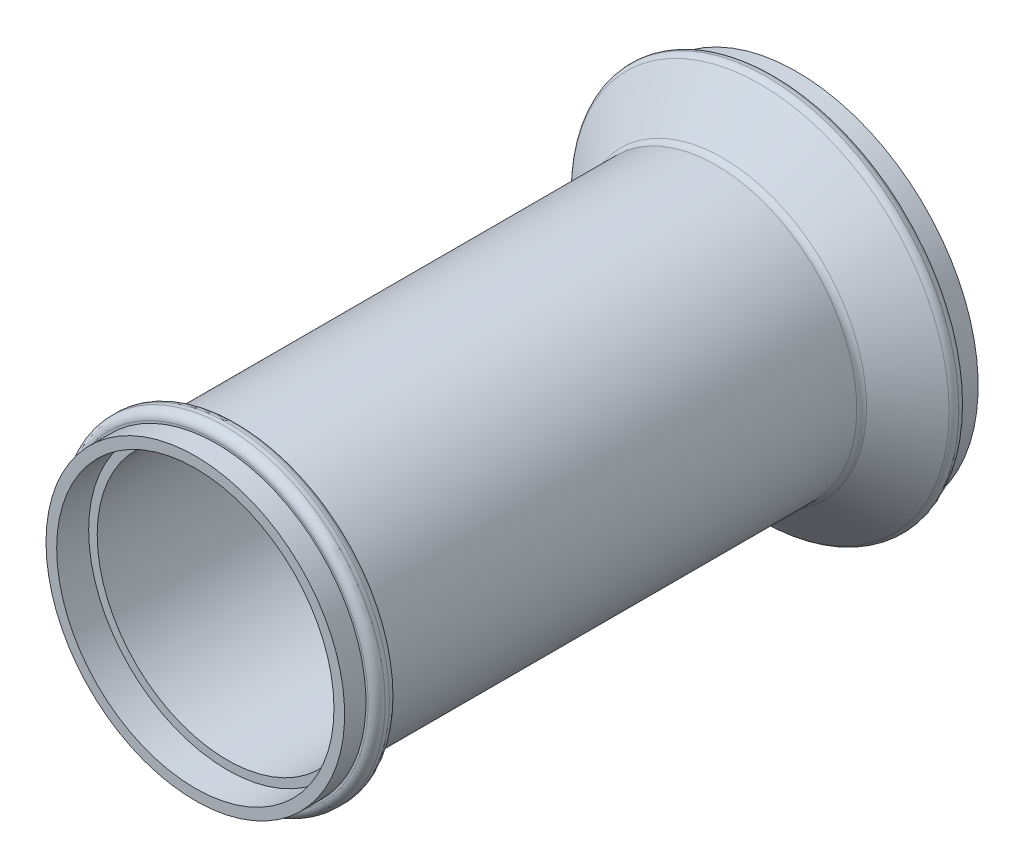
ISO-10303-21;
HEADER;
FILE_DESCRIPTION(('STEP AP214'),'2;1');
FILE_NAME('part.step','',(''),(''),'','','');
FILE_SCHEMA(('AUTOMOTIVE_DESIGN { 1 0 10303 214 1 1 1 1 }'));
ENDSEC;
DATA;
#1=APPLICATION_CONTEXT('core data for automotive mechanical design processes');
#2=APPLICATION_PROTOCOL_DEFINITION('international standard','automotive_design',2000,#1);
#3=PRODUCT_CONTEXT('',#1,'mechanical');
#4=PRODUCT('Part','Part','',(#3));
#5=PRODUCT_RELATED_PRODUCT_CATEGORY('part','',(#4));
#6=PRODUCT_DEFINITION_FORMATION('','',#4);
#7=PRODUCT_DEFINITION_CONTEXT('part definition',#1,'design');
#8=PRODUCT_DEFINITION('design','',#6,#7);
#9=PRODUCT_DEFINITION_SHAPE('','',#8);
#10=(LENGTH_UNIT() NAMED_UNIT(*) SI_UNIT(.MILLI.,.METRE.));
#11=(NAMED_UNIT(*) PLANE_ANGLE_UNIT() SI_UNIT($,.RADIAN.));
#12=(NAMED_UNIT(*) SI_UNIT($,.STERADIAN.) SOLID_ANGLE_UNIT());
#13=UNCERTAINTY_MEASURE_WITH_UNIT(LENGTH_MEASURE(1.E-05),#10,'distance_accuracy_value','');
#14=(GEOMETRIC_REPRESENTATION_CONTEXT(3) GLOBAL_UNCERTAINTY_ASSIGNED_CONTEXT((#13)) GLOBAL_UNIT_ASSIGNED_CONTEXT((#10,
#11,#12)) REPRESENTATION_CONTEXT('',''));
#15=CARTESIAN_POINT('',(0.,0.,0.));
#16=DIRECTION('',(0.,0.,1.));
#17=DIRECTION('',(1.,0.,0.));
#18=AXIS2_PLACEMENT_3D('',#15,#16,#17);
#19=CARTESIAN_POINT('',(0.,0.,0.));
#20=DIRECTION('',(0.,0.,1.));
#21=DIRECTION('',(1.,0.,0.));
#22=AXIS2_PLACEMENT_3D('',#19,#20,#21);
#23=PLANE('',#22);
#24=CARTESIAN_POINT('',(0.,0.,0.));
#25=DIRECTION('',(0.,0.,-1.));
#26=DIRECTION('',(-1.,0.,0.));
#27=AXIS2_PLACEMENT_3D('',#24,#25,#26);
#28=CIRCLE('',#27,40.);
#29=CARTESIAN_POINT('',(-40.,0.,0.));
#30=VERTEX_POINT('',#29);
#31=EDGE_CURVE('E93',#30,#30,#28,.T.);
#32=ORIENTED_EDGE('',*,*,#31,.F.);
#33=EDGE_LOOP('',(#32));
#34=FACE_BOUND('',#33,.T.);
#35=CARTESIAN_POINT('',(0.,0.,0.));
#36=DIRECTION('',(0.,0.,-1.));
#37=DIRECTION('',(-1.,0.,0.));
#38=AXIS2_PLACEMENT_3D('',#35,#36,#37);
#39=CIRCLE('',#38,42.5);
#40=CARTESIAN_POINT('',(-42.5,0.,0.));
#41=VERTEX_POINT('',#40);
#42=EDGE_CURVE('E78',#41,#41,#39,.T.);
#43=ORIENTED_EDGE('',*,*,#42,.T.);
#44=EDGE_LOOP('',(#43));
#45=FACE_BOUND('',#44,.T.);
#46=ADVANCED_FACE('F34',(#34,#45),#23,.F.);
#47=CARTESIAN_POINT('',(0.,0.,0.));
#48=DIRECTION('',(0.,0.,-1.));
#49=DIRECTION('',(-1.,0.,0.));
#50=AXIS2_PLACEMENT_3D('',#47,#48,#49);
#51=CYLINDRICAL_SURFACE('',#50,42.5);
#52=ORIENTED_EDGE('',*,*,#42,.F.);
#53=EDGE_LOOP('',(#52));
#54=FACE_BOUND('',#53,.T.);
#55=CARTESIAN_POINT('',(0.,0.,5.));
#56=DIRECTION('',(0.,0.,-1.));
#57=DIRECTION('',(-1.,0.,0.));
#58=AXIS2_PLACEMENT_3D('',#55,#56,#57);
#59=CIRCLE('',#58,42.5);
#60=CARTESIAN_POINT('',(-42.5,0.,5.00000000000001));
#61=VERTEX_POINT('',#60);
#62=EDGE_CURVE('E81',#61,#61,#59,.T.);
#63=ORIENTED_EDGE('',*,*,#62,.T.);
#64=EDGE_LOOP('',(#63));
#65=FACE_BOUND('',#64,.T.);
#66=ADVANCED_FACE('F128',(#54,#65),#51,.T.);
#67=CARTESIAN_POINT('',(42.5,0.,5.));
#68=DIRECTION('',(0.,0.,1.));
#69=DIRECTION('',(1.,0.,0.));
#70=AXIS2_PLACEMENT_3D('',#67,#68,#69);
#71=PLANE('',#70);
#72=CARTESIAN_POINT('',(0.,0.,5.));
#73=DIRECTION('',(0.,0.,1.));
#74=DIRECTION('',(1.,0.,0.));
#75=AXIS2_PLACEMENT_3D('',#72,#73,#74);
#76=CIRCLE('',#75,43.);
#77=CARTESIAN_POINT('',(43.,0.,5.));
#78=VERTEX_POINT('',#77);
#79=EDGE_CURVE('E10',#78,#78,#76,.F.);
#80=ORIENTED_EDGE('',*,*,#79,.T.);
#81=EDGE_LOOP('',(#80));
#82=FACE_BOUND('',#81,.T.);
#83=ORIENTED_EDGE('',*,*,#62,.F.);
#84=EDGE_LOOP('',(#83));
#85=FACE_BOUND('',#84,.T.);
#86=ADVANCED_FACE('F134',(#82,#85),#71,.F.);
#87=CARTESIAN_POINT('',(0.,0.,0.));
#88=DIRECTION('',(0.,0.,-1.));
#89=DIRECTION('',(-1.,0.,0.));
#90=AXIS2_PLACEMENT_3D('',#87,#88,#89);
#91=CYLINDRICAL_SURFACE('',#90,45.);
#92=CARTESIAN_POINT('',(0.,0.,7.06325010803113));
#93=DIRECTION('',(0.,0.,1.));
#94=DIRECTION('',(1.,0.,0.));
#95=AXIS2_PLACEMENT_3D('',#92,#93,#94);
#96=CIRCLE('',#95,45.);
#97=CARTESIAN_POINT('',(45.,0.,7.06325010803112));
#98=VERTEX_POINT('',#97);
#99=EDGE_CURVE('E41',#98,#98,#96,.F.);
#100=ORIENTED_EDGE('',*,*,#99,.T.);
#101=EDGE_LOOP('',(#100));
#102=FACE_BOUND('',#101,.T.);
#103=CARTESIAN_POINT('',(0.,0.,7.));
#104=DIRECTION('',(0.,0.,1.));
#105=DIRECTION('',(1.,0.,0.));
#106=AXIS2_PLACEMENT_3D('',#103,#104,#105);
#107=CIRCLE('',#106,45.);
#108=CARTESIAN_POINT('',(45.,0.,7.));
#109=VERTEX_POINT('',#108);
#110=EDGE_CURVE('E45',#109,#109,#107,.T.);
#111=ORIENTED_EDGE('',*,*,#110,.T.);
#112=EDGE_LOOP('',(#111));
#113=FACE_BOUND('',#112,.T.);
#114=ADVANCED_FACE('F167',(#102,#113),#91,.T.);
#115=CARTESIAN_POINT('',(0.,0.,18.));
#116=DIRECTION('',(0.,0.,-1.));
#117=DIRECTION('',(-1.,0.,0.));
#118=AXIS2_PLACEMENT_3D('',#115,#116,#117);
#119=CONICAL_SURFACE('',#118,33.,0.876058050598193);
#120=CARTESIAN_POINT('',(0.,0.,17.4003073327741));
#121=DIRECTION('',(0.,0.,-1.));
#122=DIRECTION('',(-1.,0.,0.));
#123=AXIS2_PLACEMENT_3D('',#120,#121,#122);
#124=CIRCLE('',#123,33.719631200671);
#125=CARTESIAN_POINT('',(-33.719631200671,0.,17.4003073327741));
#126=VERTEX_POINT('',#125);
#127=EDGE_CURVE('E49',#126,#126,#124,.T.);
#128=ORIENTED_EDGE('',*,*,#127,.T.);
#129=EDGE_LOOP('',(#128));
#130=FACE_BOUND('',#129,.T.);
#131=CARTESIAN_POINT('',(0.,0.,8.59969266722588));
#132=DIRECTION('',(0.,0.,1.));
#133=DIRECTION('',(1.,0.,0.));
#134=AXIS2_PLACEMENT_3D('',#131,#132,#133);
#135=CIRCLE('',#134,44.280368799329);
#136=CARTESIAN_POINT('',(44.280368799329,0.,8.59969266722587));
#137=VERTEX_POINT('',#136);
#138=EDGE_CURVE('E54',#137,#137,#135,.T.);
#139=ORIENTED_EDGE('',*,*,#138,.T.);
#140=EDGE_LOOP('',(#139));
#141=FACE_BOUND('',#140,.T.);
#142=ADVANCED_FACE('F164',(#130,#141),#119,.T.);
#143=CARTESIAN_POINT('',(0.,0.,0.));
#144=DIRECTION('',(0.,0.,-1.));
#145=DIRECTION('',(-1.,0.,0.));
#146=AXIS2_PLACEMENT_3D('',#143,#144,#145);
#147=CYLINDRICAL_SURFACE('',#146,33.);
#148=CARTESIAN_POINT('',(0.,0.,129.));
#149=DIRECTION('',(0.,0.,1.));
#150=DIRECTION('',(1.,0.,0.));
#151=AXIS2_PLACEMENT_3D('',#148,#149,#150);
#152=CIRCLE('',#151,33.);
#153=CARTESIAN_POINT('',(33.,0.,129.));
#154=VERTEX_POINT('',#153);
#155=EDGE_CURVE('E57',#154,#154,#152,.F.);
#156=ORIENTED_EDGE('',*,*,#155,.T.);
#157=EDGE_LOOP('',(#156));
#158=FACE_BOUND('',#157,.T.);
#159=CARTESIAN_POINT('',(0.,0.,18.9367498919689));
#160=DIRECTION('',(0.,0.,-1.));
#161=DIRECTION('',(-1.,0.,0.));
#162=AXIS2_PLACEMENT_3D('',#159,#160,#161);
#163=CIRCLE('',#162,33.);
#164=CARTESIAN_POINT('',(-33.,0.,18.9367498919689));
#165=VERTEX_POINT('',#164);
#166=EDGE_CURVE('E60',#165,#165,#163,.F.);
#167=ORIENTED_EDGE('',*,*,#166,.T.);
#168=EDGE_LOOP('',(#167));
#169=FACE_BOUND('',#168,.T.);
#170=ADVANCED_FACE('F166',(#158,#169),#147,.T.);
#171=CARTESIAN_POINT('',(33.,0.,131.));
#172=DIRECTION('',(0.,0.,1.));
#173=DIRECTION('',(1.,0.,0.));
#174=AXIS2_PLACEMENT_3D('',#171,#172,#173);
#175=PLANE('',#174);
#176=CARTESIAN_POINT('',(0.,0.,131.));
#177=DIRECTION('',(0.,0.,1.));
#178=DIRECTION('',(1.,0.,0.));
#179=AXIS2_PLACEMENT_3D('',#176,#177,#178);
#180=CIRCLE('',#179,35.5);
#181=CARTESIAN_POINT('',(35.5,0.,131.));
#182=VERTEX_POINT('',#181);
#183=EDGE_CURVE('E63',#182,#182,#180,.F.);
#184=ORIENTED_EDGE('',*,*,#183,.T.);
#185=EDGE_LOOP('',(#184));
#186=FACE_BOUND('',#185,.T.);
#187=CARTESIAN_POINT('',(0.,0.,131.));
#188=DIRECTION('',(0.,0.,1.));
#189=DIRECTION('',(1.,0.,0.));
#190=AXIS2_PLACEMENT_3D('',#187,#188,#189);
#191=CIRCLE('',#190,35.);
#192=CARTESIAN_POINT('',(35.,0.,131.));
#193=VERTEX_POINT('',#192);
#194=EDGE_CURVE('E66',#193,#193,#191,.T.);
#195=ORIENTED_EDGE('',*,*,#194,.T.);
#196=EDGE_LOOP('',(#195));
#197=FACE_BOUND('',#196,.T.);
#198=ADVANCED_FACE('F174',(#186,#197),#175,.F.);
#199=CARTESIAN_POINT('',(0.,0.,0.));
#200=DIRECTION('',(0.,0.,-1.));
#201=DIRECTION('',(-1.,0.,0.));
#202=AXIS2_PLACEMENT_3D('',#199,#200,#201);
#203=CYLINDRICAL_SURFACE('',#202,37.5);
#204=CARTESIAN_POINT('',(0.,0.,134.));
#205=DIRECTION('',(0.,0.,-1.));
#206=DIRECTION('',(-1.,0.,0.));
#207=AXIS2_PLACEMENT_3D('',#204,#205,#206);
#208=CIRCLE('',#207,37.5);
#209=CARTESIAN_POINT('',(-37.5,0.,134.));
#210=VERTEX_POINT('',#209);
#211=EDGE_CURVE('E72',#210,#210,#208,.T.);
#212=ORIENTED_EDGE('',*,*,#211,.T.);
#213=EDGE_LOOP('',(#212));
#214=FACE_BOUND('',#213,.T.);
#215=CARTESIAN_POINT('',(0.,0.,133.));
#216=DIRECTION('',(0.,0.,1.));
#217=DIRECTION('',(1.,0.,0.));
#218=AXIS2_PLACEMENT_3D('',#215,#216,#217);
#219=CIRCLE('',#218,37.5);
#220=CARTESIAN_POINT('',(37.5,0.,133.));
#221=VERTEX_POINT('',#220);
#222=EDGE_CURVE('E75',#221,#221,#219,.T.);
#223=ORIENTED_EDGE('',*,*,#222,.T.);
#224=EDGE_LOOP('',(#223));
#225=FACE_BOUND('',#224,.T.);
#226=ADVANCED_FACE('F211',(#214,#225),#203,.T.);
#227=CARTESIAN_POINT('',(37.5,0.,136.));
#228=DIRECTION('',(0.,0.,-1.));
#229=DIRECTION('',(-1.,0.,0.));
#230=AXIS2_PLACEMENT_3D('',#227,#228,#229);
#231=PLANE('',#230);
#232=CARTESIAN_POINT('',(0.,0.,136.));
#233=DIRECTION('',(0.,0.,-1.));
#234=DIRECTION('',(-1.,0.,0.));
#235=AXIS2_PLACEMENT_3D('',#232,#233,#234);
#236=CIRCLE('',#235,35.5);
#237=CARTESIAN_POINT('',(-35.5,0.,136.));
#238=VERTEX_POINT('',#237);
#239=EDGE_CURVE('E69',#238,#238,#236,.F.);
#240=ORIENTED_EDGE('',*,*,#239,.T.);
#241=EDGE_LOOP('',(#240));
#242=FACE_BOUND('',#241,.T.);
#243=CARTESIAN_POINT('',(0.,0.,136.));
#244=DIRECTION('',(0.,0.,-1.));
#245=DIRECTION('',(-1.,0.,0.));
#246=AXIS2_PLACEMENT_3D('',#243,#244,#245);
#247=CIRCLE('',#246,35.);
#248=CARTESIAN_POINT('',(-35.,0.,136.));
#249=VERTEX_POINT('',#248);
#250=EDGE_CURVE('E84',#249,#249,#247,.T.);
#251=ORIENTED_EDGE('',*,*,#250,.T.);
#252=EDGE_LOOP('',(#251));
#253=FACE_BOUND('',#252,.T.);
#254=ADVANCED_FACE('F220',(#242,#253),#231,.F.);
#255=CARTESIAN_POINT('',(0.,0.,0.));
#256=DIRECTION('',(0.,0.,-1.));
#257=DIRECTION('',(-1.,0.,0.));
#258=AXIS2_PLACEMENT_3D('',#255,#256,#257);
#259=CYLINDRICAL_SURFACE('',#258,35.);
#260=ORIENTED_EDGE('',*,*,#250,.F.);
#261=EDGE_LOOP('',(#260));
#262=FACE_BOUND('',#261,.T.);
#263=CARTESIAN_POINT('',(0.,0.,141.));
#264=DIRECTION('',(0.,0.,-1.));
#265=DIRECTION('',(-1.,0.,0.));
#266=AXIS2_PLACEMENT_3D('',#263,#264,#265);
#267=CIRCLE('',#266,35.);
#268=CARTESIAN_POINT('',(-35.,0.,141.));
#269=VERTEX_POINT('',#268);
#270=EDGE_CURVE('E87',#269,#269,#267,.T.);
#271=ORIENTED_EDGE('',*,*,#270,.T.);
#272=EDGE_LOOP('',(#271));
#273=FACE_BOUND('',#272,.T.);
#274=ADVANCED_FACE('F230',(#262,#273),#259,.T.);
#275=CARTESIAN_POINT('',(35.,0.,141.));
#276=DIRECTION('',(0.,0.,-1.));
#277=DIRECTION('',(-1.,0.,0.));
#278=AXIS2_PLACEMENT_3D('',#275,#276,#277);
#279=PLANE('',#278);
#280=CARTESIAN_POINT('',(0.,0.,141.));
#281=DIRECTION('',(0.,0.,-1.));
#282=DIRECTION('',(-1.,0.,0.));
#283=AXIS2_PLACEMENT_3D('',#280,#281,#282);
#284=CIRCLE('',#283,32.5);
#285=CARTESIAN_POINT('',(-32.5,0.,141.));
#286=VERTEX_POINT('',#285);
#287=EDGE_CURVE('E96',#286,#286,#284,.T.);
#288=ORIENTED_EDGE('',*,*,#287,.T.);
#289=EDGE_LOOP('',(#288));
#290=FACE_BOUND('',#289,.T.);
#291=ORIENTED_EDGE('',*,*,#270,.F.);
#292=EDGE_LOOP('',(#291));
#293=FACE_BOUND('',#292,.T.);
#294=ADVANCED_FACE('F145',(#290,#293),#279,.F.);
#295=CARTESIAN_POINT('',(0.,0.,134.));
#296=DIRECTION('',(0.,0.,-1.));
#297=DIRECTION('',(-1.,0.,0.));
#298=AXIS2_PLACEMENT_3D('',#295,#296,#297);
#299=TOROIDAL_SURFACE('',#298,35.5,2.);
#300=ORIENTED_EDGE('',*,*,#239,.F.);
#301=EDGE_LOOP('',(#300));
#302=FACE_BOUND('',#301,.T.);
#303=ORIENTED_EDGE('',*,*,#211,.F.);
#304=EDGE_LOOP('',(#303));
#305=FACE_BOUND('',#304,.T.);
#306=ADVANCED_FACE('F141',(#302,#305),#299,.T.);
#307=CARTESIAN_POINT('',(0.,0.,133.));
#308=DIRECTION('',(0.,0.,1.));
#309=DIRECTION('',(1.,0.,0.));
#310=AXIS2_PLACEMENT_3D('',#307,#308,#309);
#311=TOROIDAL_SURFACE('',#310,35.5,2.);
#312=ORIENTED_EDGE('',*,*,#222,.F.);
#313=EDGE_LOOP('',(#312));
#314=FACE_BOUND('',#313,.T.);
#315=ORIENTED_EDGE('',*,*,#183,.F.);
#316=EDGE_LOOP('',(#315));
#317=FACE_BOUND('',#316,.T.);
#318=ADVANCED_FACE('F144',(#314,#317),#311,.T.);
#319=CARTESIAN_POINT('',(0.,0.,129.));
#320=DIRECTION('',(0.,0.,1.));
#321=DIRECTION('',(1.,0.,0.));
#322=AXIS2_PLACEMENT_3D('',#319,#320,#321);
#323=TOROIDAL_SURFACE('',#322,35.,2.);
#324=ORIENTED_EDGE('',*,*,#194,.F.);
#325=EDGE_LOOP('',(#324));
#326=FACE_BOUND('',#325,.T.);
#327=ORIENTED_EDGE('',*,*,#155,.F.);
#328=EDGE_LOOP('',(#327));
#329=FACE_BOUND('',#328,.T.);
#330=ADVANCED_FACE('F149',(#326,#329),#323,.F.);
#331=CARTESIAN_POINT('',(0.,0.,18.9367498919689));
#332=DIRECTION('',(0.,0.,-1.));
#333=DIRECTION('',(-1.,0.,0.));
#334=AXIS2_PLACEMENT_3D('',#331,#332,#333);
#335=TOROIDAL_SURFACE('',#334,35.,2.);
#336=ORIENTED_EDGE('',*,*,#166,.F.);
#337=EDGE_LOOP('',(#336));
#338=FACE_BOUND('',#337,.T.);
#339=ORIENTED_EDGE('',*,*,#127,.F.);
#340=EDGE_LOOP('',(#339));
#341=FACE_BOUND('',#340,.T.);
#342=ADVANCED_FACE('F153',(#338,#341),#335,.F.);
#343=CARTESIAN_POINT('',(0.,0.,7.06325010803113));
#344=DIRECTION('',(0.,0.,1.));
#345=DIRECTION('',(1.,0.,0.));
#346=AXIS2_PLACEMENT_3D('',#343,#344,#345);
#347=TOROIDAL_SURFACE('',#346,43.,2.);
#348=ORIENTED_EDGE('',*,*,#138,.F.);
#349=EDGE_LOOP('',(#348));
#350=FACE_BOUND('',#349,.T.);
#351=ORIENTED_EDGE('',*,*,#99,.F.);
#352=EDGE_LOOP('',(#351));
#353=FACE_BOUND('',#352,.T.);
#354=ADVANCED_FACE('F124',(#350,#353),#347,.T.);
#355=CARTESIAN_POINT('',(0.,0.,7.));
#356=DIRECTION('',(0.,0.,1.));
#357=DIRECTION('',(1.,0.,0.));
#358=AXIS2_PLACEMENT_3D('',#355,#356,#357);
#359=TOROIDAL_SURFACE('',#358,43.,2.);
#360=ORIENTED_EDGE('',*,*,#110,.F.);
#361=EDGE_LOOP('',(#360));
#362=FACE_BOUND('',#361,.T.);
#363=ORIENTED_EDGE('',*,*,#79,.F.);
#364=EDGE_LOOP('',(#363));
#365=FACE_BOUND('',#364,.T.);
#366=ADVANCED_FACE('F36',(#362,#365),#359,.T.);
#367=CARTESIAN_POINT('',(0.,0.,16.8290626350389));
#368=DIRECTION('',(0.,0.,-1.));
#369=DIRECTION('',(-1.,0.,0.));
#370=AXIS2_PLACEMENT_3D('',#367,#368,#369);
#371=CONICAL_SURFACE('',#370,30.5,0.876058050598193);
#372=CARTESIAN_POINT('',(0.,0.,8.91239596837223));
#373=DIRECTION('',(0.,0.,-1.));
#374=DIRECTION('',(-1.,0.,0.));
#375=AXIS2_PLACEMENT_3D('',#372,#373,#374);
#376=CIRCLE('',#375,40.);
#377=CARTESIAN_POINT('',(-40.,0.,8.91239596837223));
#378=VERTEX_POINT('',#377);
#379=EDGE_CURVE('E90',#378,#378,#376,.T.);
#380=ORIENTED_EDGE('',*,*,#379,.T.);
#381=EDGE_LOOP('',(#380));
#382=FACE_BOUND('',#381,.T.);
#383=CARTESIAN_POINT('',(0.,0.,16.8290626350389));
#384=DIRECTION('',(0.,0.,-1.));
#385=DIRECTION('',(-1.,0.,0.));
#386=AXIS2_PLACEMENT_3D('',#383,#384,#385);
#387=CIRCLE('',#386,30.5);
#388=CARTESIAN_POINT('',(-30.5,0.,16.8290626350389));
#389=VERTEX_POINT('',#388);
#390=EDGE_CURVE('E105',#389,#389,#387,.T.);
#391=ORIENTED_EDGE('',*,*,#390,.F.);
#392=EDGE_LOOP('',(#391));
#393=FACE_BOUND('',#392,.T.);
#394=ADVANCED_FACE('F112',(#382,#393),#371,.F.);
#395=CARTESIAN_POINT('',(0.,0.,0.));
#396=DIRECTION('',(0.,0.,-1.));
#397=DIRECTION('',(-1.,0.,0.));
#398=AXIS2_PLACEMENT_3D('',#395,#396,#397);
#399=CYLINDRICAL_SURFACE('',#398,40.);
#400=ORIENTED_EDGE('',*,*,#31,.T.);
#401=EDGE_LOOP('',(#400));
#402=FACE_BOUND('',#401,.T.);
#403=ORIENTED_EDGE('',*,*,#379,.F.);
#404=EDGE_LOOP('',(#403));
#405=FACE_BOUND('',#404,.T.);
#406=ADVANCED_FACE('F114',(#402,#405),#399,.F.);
#407=CARTESIAN_POINT('',(0.,0.,0.));
#408=DIRECTION('',(0.,0.,-1.));
#409=DIRECTION('',(-1.,0.,0.));
#410=AXIS2_PLACEMENT_3D('',#407,#408,#409);
#411=CYLINDRICAL_SURFACE('',#410,32.5);
#412=CARTESIAN_POINT('',(0.,0.,133.5));
#413=DIRECTION('',(0.,0.,-1.));
#414=DIRECTION('',(-1.,0.,0.));
#415=AXIS2_PLACEMENT_3D('',#412,#413,#414);
#416=CIRCLE('',#415,32.5);
#417=CARTESIAN_POINT('',(-32.5,0.,133.5));
#418=VERTEX_POINT('',#417);
#419=EDGE_CURVE('E99',#418,#418,#416,.T.);
#420=ORIENTED_EDGE('',*,*,#419,.T.);
#421=EDGE_LOOP('',(#420));
#422=FACE_BOUND('',#421,.T.);
#423=ORIENTED_EDGE('',*,*,#287,.F.);
#424=EDGE_LOOP('',(#423));
#425=FACE_BOUND('',#424,.T.);
#426=ADVANCED_FACE('F121',(#422,#425),#411,.F.);
#427=CARTESIAN_POINT('',(30.5,0.,133.5));
#428=DIRECTION('',(0.,0.,1.));
#429=DIRECTION('',(1.,0.,0.));
#430=AXIS2_PLACEMENT_3D('',#427,#428,#429);
#431=PLANE('',#430);
#432=CARTESIAN_POINT('',(0.,0.,133.5));
#433=DIRECTION('',(0.,0.,-1.));
#434=DIRECTION('',(-1.,0.,0.));
#435=AXIS2_PLACEMENT_3D('',#432,#433,#434);
#436=CIRCLE('',#435,30.5);
#437=CARTESIAN_POINT('',(-30.5,0.,133.5));
#438=VERTEX_POINT('',#437);
#439=EDGE_CURVE('E102',#438,#438,#436,.T.);
#440=ORIENTED_EDGE('',*,*,#439,.T.);
#441=EDGE_LOOP('',(#440));
#442=FACE_BOUND('',#441,.T.);
#443=ORIENTED_EDGE('',*,*,#419,.F.);
#444=EDGE_LOOP('',(#443));
#445=FACE_BOUND('',#444,.T.);
#446=ADVANCED_FACE('F299',(#442,#445),#431,.T.);
#447=CARTESIAN_POINT('',(0.,0.,0.));
#448=DIRECTION('',(0.,0.,-1.));
#449=DIRECTION('',(-1.,0.,0.));
#450=AXIS2_PLACEMENT_3D('',#447,#448,#449);
#451=CYLINDRICAL_SURFACE('',#450,30.5);
#452=ORIENTED_EDGE('',*,*,#390,.T.);
#453=EDGE_LOOP('',(#452));
#454=FACE_BOUND('',#453,.T.);
#455=ORIENTED_EDGE('',*,*,#439,.F.);
#456=EDGE_LOOP('',(#455));
#457=FACE_BOUND('',#456,.T.);
#458=ADVANCED_FACE('F109',(#454,#457),#451,.F.);
#459=CLOSED_SHELL('',(#46,#66,#86,#114,#142,#170,#198,#226,#254,#274,#294,#306,#318,#330,#342,
#354,#366,#394,#406,#426,#446,#458));
#460=MANIFOLD_SOLID_BREP('B2',#459);
#461=ADVANCED_BREP_SHAPE_REPRESENTATION('',(#18,#460),#14);
#462=SHAPE_DEFINITION_REPRESENTATION(#9,#461);
ENDSEC;
END-ISO-10303-21;
